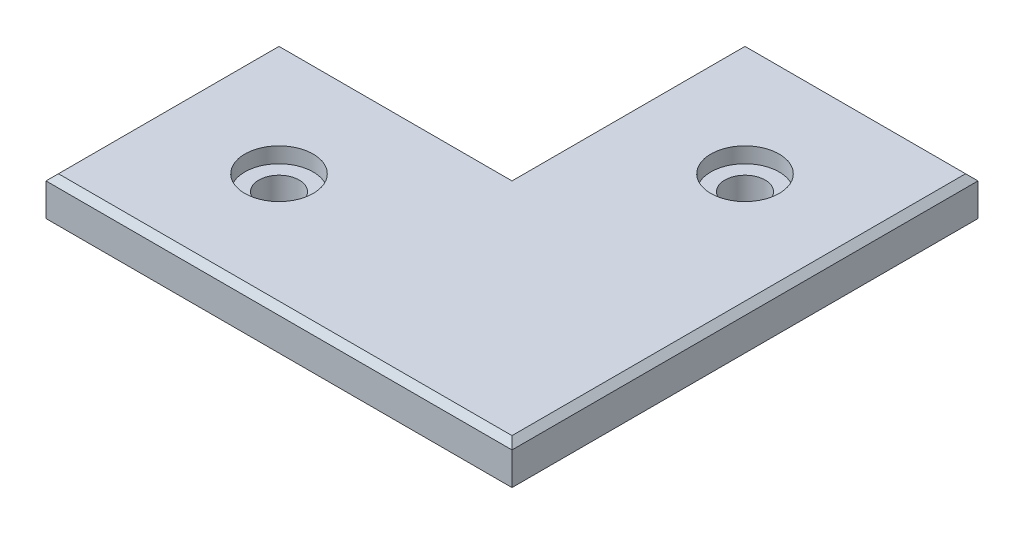
ISO-10303-21;
HEADER;
FILE_DESCRIPTION(('STEP AP214'),'2;1');
FILE_NAME('part.step','',(''),(''),'','','');
FILE_SCHEMA(('AUTOMOTIVE_DESIGN { 1 0 10303 214 1 1 1 1 }'));
ENDSEC;
DATA;
#1=APPLICATION_CONTEXT('core data for automotive mechanical design processes');
#2=APPLICATION_PROTOCOL_DEFINITION('international standard','automotive_design',2000,#1);
#3=PRODUCT_CONTEXT('',#1,'mechanical');
#4=PRODUCT('Part','Part','',(#3));
#5=PRODUCT_RELATED_PRODUCT_CATEGORY('part','',(#4));
#6=PRODUCT_DEFINITION_FORMATION('','',#4);
#7=PRODUCT_DEFINITION_CONTEXT('part definition',#1,'design');
#8=PRODUCT_DEFINITION('design','',#6,#7);
#9=PRODUCT_DEFINITION_SHAPE('','',#8);
#10=(LENGTH_UNIT() NAMED_UNIT(*) SI_UNIT(.MILLI.,.METRE.));
#11=(NAMED_UNIT(*) PLANE_ANGLE_UNIT() SI_UNIT($,.RADIAN.));
#12=(NAMED_UNIT(*) SI_UNIT($,.STERADIAN.) SOLID_ANGLE_UNIT());
#13=UNCERTAINTY_MEASURE_WITH_UNIT(LENGTH_MEASURE(1.E-05),#10,'distance_accuracy_value','');
#14=(GEOMETRIC_REPRESENTATION_CONTEXT(3) GLOBAL_UNCERTAINTY_ASSIGNED_CONTEXT((#13)) GLOBAL_UNIT_ASSIGNED_CONTEXT((#10,
#11,#12)) REPRESENTATION_CONTEXT('',''));
#15=CARTESIAN_POINT('',(0.,0.,0.));
#16=DIRECTION('',(0.,0.,1.));
#17=DIRECTION('',(1.,0.,0.));
#18=AXIS2_PLACEMENT_3D('',#15,#16,#17);
#19=CARTESIAN_POINT('',(49.9092726863167,15.6894663659119,115.954429940456));
#20=DIRECTION('',(0.,-1.,0.));
#21=DIRECTION('',(0.,0.,-1.));
#22=AXIS2_PLACEMENT_3D('',#19,#20,#21);
#23=CYLINDRICAL_SURFACE('',#22,3.302);
#24=CARTESIAN_POINT('',(49.9092726863167,0.,115.954429940456));
#25=DIRECTION('',(0.,1.,0.));
#26=DIRECTION('',(0.,0.,1.));
#27=AXIS2_PLACEMENT_3D('',#24,#25,#26);
#28=CIRCLE('',#27,3.302);
#29=CARTESIAN_POINT('',(49.9092726863167,0.,119.256429940456));
#30=VERTEX_POINT('',#29);
#31=EDGE_CURVE('E136',#30,#30,#28,.T.);
#32=ORIENTED_EDGE('',*,*,#31,.F.);
#33=EDGE_LOOP('',(#32));
#34=FACE_BOUND('',#33,.T.);
#35=CARTESIAN_POINT('',(49.9092726863167,3.81,115.954429940456));
#36=DIRECTION('',(0.,1.,0.));
#37=DIRECTION('',(0.,0.,1.));
#38=AXIS2_PLACEMENT_3D('',#35,#36,#37);
#39=CIRCLE('',#38,3.302);
#40=CARTESIAN_POINT('',(49.9092726863167,3.81,119.256429940456));
#41=VERTEX_POINT('',#40);
#42=EDGE_CURVE('E160',#41,#41,#39,.T.);
#43=ORIENTED_EDGE('',*,*,#42,.T.);
#44=EDGE_LOOP('',(#43));
#45=FACE_BOUND('',#44,.T.);
#46=ADVANCED_FACE('F38',(#34,#45),#23,.F.);
#47=CARTESIAN_POINT('',(11.8092726863168,15.6894663659119,154.054429940456));
#48=DIRECTION('',(0.,-1.,0.));
#49=DIRECTION('',(0.,0.,-1.));
#50=AXIS2_PLACEMENT_3D('',#47,#48,#49);
#51=CYLINDRICAL_SURFACE('',#50,3.302);
#52=CARTESIAN_POINT('',(11.8092726863168,0.,154.054429940456));
#53=DIRECTION('',(0.,1.,0.));
#54=DIRECTION('',(0.,0.,1.));
#55=AXIS2_PLACEMENT_3D('',#52,#53,#54);
#56=CIRCLE('',#55,3.302);
#57=CARTESIAN_POINT('',(11.8092726863168,0.,157.356429940456));
#58=VERTEX_POINT('',#57);
#59=EDGE_CURVE('E133',#58,#58,#56,.T.);
#60=ORIENTED_EDGE('',*,*,#59,.F.);
#61=EDGE_LOOP('',(#60));
#62=FACE_BOUND('',#61,.T.);
#63=CARTESIAN_POINT('',(11.8092726863168,3.81,154.054429940456));
#64=DIRECTION('',(0.,1.,0.));
#65=DIRECTION('',(0.,0.,1.));
#66=AXIS2_PLACEMENT_3D('',#63,#64,#65);
#67=CIRCLE('',#66,3.302);
#68=CARTESIAN_POINT('',(11.8092726863168,3.81,157.356429940456));
#69=VERTEX_POINT('',#68);
#70=EDGE_CURVE('E157',#69,#69,#67,.T.);
#71=ORIENTED_EDGE('',*,*,#70,.T.);
#72=EDGE_LOOP('',(#71));
#73=FACE_BOUND('',#72,.T.);
#74=ADVANCED_FACE('F244',(#62,#73),#51,.F.);
#75=CARTESIAN_POINT('',(68.9592726863167,6.35,96.9044299404562));
#76=DIRECTION('',(0.,0.,1.));
#77=DIRECTION('',(1.,0.,0.));
#78=AXIS2_PLACEMENT_3D('',#75,#76,#77);
#79=PLANE('',#78);
#80=DIRECTION('',(0.,-1.,0.));
#81=VECTOR('',#80,1.);
#82=CARTESIAN_POINT('',(30.8592726863167,6.35,96.9044299404562));
#83=LINE('',#82,#81);
#84=CARTESIAN_POINT('',(30.8592726863167,5.33400000000001,96.9044299404562));
#85=VERTEX_POINT('',#84);
#86=CARTESIAN_POINT('',(30.8592726863167,0.,96.9044299404562));
#87=VERTEX_POINT('',#86);
#88=EDGE_CURVE('E109',#85,#87,#83,.T.);
#89=ORIENTED_EDGE('',*,*,#88,.F.);
#90=DIRECTION('',(1.,0.,0.));
#91=VECTOR('',#90,1.);
#92=CARTESIAN_POINT('',(68.9592726863167,5.33400000000001,96.9044299404562));
#93=LINE('',#92,#91);
#94=CARTESIAN_POINT('',(68.9592726863167,5.33400000000001,96.9044299404562));
#95=VERTEX_POINT('',#94);
#96=EDGE_CURVE('E11',#85,#95,#93,.T.);
#97=ORIENTED_EDGE('',*,*,#96,.T.);
#98=DIRECTION('',(0.,-1.,0.));
#99=VECTOR('',#98,1.);
#100=CARTESIAN_POINT('',(68.9592726863167,6.35,96.9044299404562));
#101=LINE('',#100,#99);
#102=CARTESIAN_POINT('',(68.9592726863167,0.,96.9044299404562));
#103=VERTEX_POINT('',#102);
#104=EDGE_CURVE('E131',#95,#103,#101,.T.);
#105=ORIENTED_EDGE('',*,*,#104,.T.);
#106=DIRECTION('',(-1.,0.,0.));
#107=VECTOR('',#106,1.);
#108=CARTESIAN_POINT('',(68.9592726863167,0.,96.9044299404562));
#109=LINE('',#108,#107);
#110=EDGE_CURVE('E124',#103,#87,#109,.T.);
#111=ORIENTED_EDGE('',*,*,#110,.T.);
#112=EDGE_LOOP('',(#89,#97,#105,#111));
#113=FACE_BOUND('',#112,.T.);
#114=ADVANCED_FACE('F129',(#113),#79,.F.);
#115=CARTESIAN_POINT('',(30.8592726863167,6.35,96.9044299404562));
#116=DIRECTION('',(1.,0.,0.));
#117=DIRECTION('',(0.,0.,-1.));
#118=AXIS2_PLACEMENT_3D('',#115,#116,#117);
#119=PLANE('',#118);
#120=DIRECTION('',(0.,-1.,0.));
#121=VECTOR('',#120,1.);
#122=CARTESIAN_POINT('',(30.8592726863167,6.35,135.004429940456));
#123=LINE('',#122,#121);
#124=CARTESIAN_POINT('',(30.8592726863167,5.33400000000001,135.004429940456));
#125=VERTEX_POINT('',#124);
#126=CARTESIAN_POINT('',(30.8592726863167,0.,135.004429940456));
#127=VERTEX_POINT('',#126);
#128=EDGE_CURVE('E118',#125,#127,#123,.T.);
#129=ORIENTED_EDGE('',*,*,#128,.F.);
#130=DIRECTION('',(0.,0.,-1.));
#131=VECTOR('',#130,1.);
#132=CARTESIAN_POINT('',(30.8592726863167,5.33400000000001,96.9044299404562));
#133=LINE('',#132,#131);
#134=EDGE_CURVE('E48',#125,#85,#133,.T.);
#135=ORIENTED_EDGE('',*,*,#134,.T.);
#136=ORIENTED_EDGE('',*,*,#88,.T.);
#137=DIRECTION('',(0.,0.,1.));
#138=VECTOR('',#137,1.);
#139=CARTESIAN_POINT('',(30.8592726863167,0.,96.9044299404562));
#140=LINE('',#139,#138);
#141=EDGE_CURVE('E112',#87,#127,#140,.T.);
#142=ORIENTED_EDGE('',*,*,#141,.T.);
#143=EDGE_LOOP('',(#129,#135,#136,#142));
#144=FACE_BOUND('',#143,.T.);
#145=ADVANCED_FACE('F111',(#144),#119,.F.);
#146=CARTESIAN_POINT('',(30.8592726863167,6.35,135.004429940456));
#147=DIRECTION('',(0.,0.,1.));
#148=DIRECTION('',(1.,0.,0.));
#149=AXIS2_PLACEMENT_3D('',#146,#147,#148);
#150=PLANE('',#149);
#151=DIRECTION('',(0.,-1.,0.));
#152=VECTOR('',#151,1.);
#153=CARTESIAN_POINT('',(-7.2407273136832,6.35,135.004429940456));
#154=LINE('',#153,#152);
#155=CARTESIAN_POINT('',(-7.2407273136832,5.33400000000001,135.004429940456));
#156=VERTEX_POINT('',#155);
#157=CARTESIAN_POINT('',(-7.2407273136832,0.,135.004429940456));
#158=VERTEX_POINT('',#157);
#159=EDGE_CURVE('E154',#156,#158,#154,.T.);
#160=ORIENTED_EDGE('',*,*,#159,.F.);
#161=DIRECTION('',(1.,0.,0.));
#162=VECTOR('',#161,1.);
#163=CARTESIAN_POINT('',(30.8592726863167,5.33400000000001,135.004429940456));
#164=LINE('',#163,#162);
#165=EDGE_CURVE('E63',#156,#125,#164,.T.);
#166=ORIENTED_EDGE('',*,*,#165,.T.);
#167=ORIENTED_EDGE('',*,*,#128,.T.);
#168=DIRECTION('',(-1.,0.,0.));
#169=VECTOR('',#168,1.);
#170=CARTESIAN_POINT('',(30.8592726863167,0.,135.004429940456));
#171=LINE('',#170,#169);
#172=EDGE_CURVE('E127',#127,#158,#171,.T.);
#173=ORIENTED_EDGE('',*,*,#172,.T.);
#174=EDGE_LOOP('',(#160,#166,#167,#173));
#175=FACE_BOUND('',#174,.T.);
#176=ADVANCED_FACE('F384',(#175),#150,.F.);
#177=CARTESIAN_POINT('',(-7.2407273136832,6.35,135.004429940456));
#178=DIRECTION('',(1.,0.,0.));
#179=DIRECTION('',(0.,0.,-1.));
#180=AXIS2_PLACEMENT_3D('',#177,#178,#179);
#181=PLANE('',#180);
#182=DIRECTION('',(0.,-1.,0.));
#183=VECTOR('',#182,1.);
#184=CARTESIAN_POINT('',(-7.24072731368319,6.35,173.104429940456));
#185=LINE('',#184,#183);
#186=CARTESIAN_POINT('',(-7.24072731368319,5.33400000000001,173.104429940456));
#187=VERTEX_POINT('',#186);
#188=CARTESIAN_POINT('',(-7.24072731368319,0.,173.104429940456));
#189=VERTEX_POINT('',#188);
#190=EDGE_CURVE('E152',#187,#189,#185,.T.);
#191=ORIENTED_EDGE('',*,*,#190,.F.);
#192=DIRECTION('',(0.,0.,-1.));
#193=VECTOR('',#192,1.);
#194=CARTESIAN_POINT('',(-7.2407273136832,5.33400000000001,135.004429940456));
#195=LINE('',#194,#193);
#196=EDGE_CURVE('E181',#187,#156,#195,.T.);
#197=ORIENTED_EDGE('',*,*,#196,.T.);
#198=ORIENTED_EDGE('',*,*,#159,.T.);
#199=DIRECTION('',(0.,0.,1.));
#200=VECTOR('',#199,1.);
#201=CARTESIAN_POINT('',(-7.2407273136832,0.,135.004429940456));
#202=LINE('',#201,#200);
#203=EDGE_CURVE('E141',#158,#189,#202,.T.);
#204=ORIENTED_EDGE('',*,*,#203,.T.);
#205=EDGE_LOOP('',(#191,#197,#198,#204));
#206=FACE_BOUND('',#205,.T.);
#207=ADVANCED_FACE('F375',(#206),#181,.F.);
#208=CARTESIAN_POINT('',(-7.24072731368319,6.35,173.104429940456));
#209=DIRECTION('',(0.,0.,-1.));
#210=DIRECTION('',(-1.,0.,0.));
#211=AXIS2_PLACEMENT_3D('',#208,#209,#210);
#212=PLANE('',#211);
#213=DIRECTION('',(0.,-1.,0.));
#214=VECTOR('',#213,1.);
#215=CARTESIAN_POINT('',(68.9592726863166,6.35,173.104429940456));
#216=LINE('',#215,#214);
#217=CARTESIAN_POINT('',(68.9592726863166,5.33400000000001,173.104429940456));
#218=VERTEX_POINT('',#217);
#219=CARTESIAN_POINT('',(68.9592726863166,0.,173.104429940456));
#220=VERTEX_POINT('',#219);
#221=EDGE_CURVE('E150',#218,#220,#216,.T.);
#222=ORIENTED_EDGE('',*,*,#221,.F.);
#223=DIRECTION('',(-1.,0.,0.));
#224=VECTOR('',#223,1.);
#225=CARTESIAN_POINT('',(-7.24072731368319,5.33400000000001,173.104429940456));
#226=LINE('',#225,#224);
#227=EDGE_CURVE('E179',#218,#187,#226,.T.);
#228=ORIENTED_EDGE('',*,*,#227,.T.);
#229=ORIENTED_EDGE('',*,*,#190,.T.);
#230=DIRECTION('',(1.,0.,0.));
#231=VECTOR('',#230,1.);
#232=CARTESIAN_POINT('',(-7.24072731368319,0.,173.104429940456));
#233=LINE('',#232,#231);
#234=EDGE_CURVE('E144',#189,#220,#233,.T.);
#235=ORIENTED_EDGE('',*,*,#234,.T.);
#236=EDGE_LOOP('',(#222,#228,#229,#235));
#237=FACE_BOUND('',#236,.T.);
#238=ADVANCED_FACE('F239',(#237),#212,.F.);
#239=CARTESIAN_POINT('',(68.9592726863166,6.35,173.104429940456));
#240=DIRECTION('',(-1.,0.,0.));
#241=DIRECTION('',(0.,0.,1.));
#242=AXIS2_PLACEMENT_3D('',#239,#240,#241);
#243=PLANE('',#242);
#244=ORIENTED_EDGE('',*,*,#104,.F.);
#245=DIRECTION('',(0.,0.,1.));
#246=VECTOR('',#245,1.);
#247=CARTESIAN_POINT('',(68.9592726863166,5.33400000000001,173.104429940456));
#248=LINE('',#247,#246);
#249=EDGE_CURVE('E176',#95,#218,#248,.T.);
#250=ORIENTED_EDGE('',*,*,#249,.T.);
#251=ORIENTED_EDGE('',*,*,#221,.T.);
#252=DIRECTION('',(0.,0.,-1.));
#253=VECTOR('',#252,1.);
#254=CARTESIAN_POINT('',(68.9592726863166,0.,173.104429940456));
#255=LINE('',#254,#253);
#256=EDGE_CURVE('E147',#220,#103,#255,.T.);
#257=ORIENTED_EDGE('',*,*,#256,.T.);
#258=EDGE_LOOP('',(#244,#250,#251,#257));
#259=FACE_BOUND('',#258,.T.);
#260=ADVANCED_FACE('F230',(#259),#243,.F.);
#261=CARTESIAN_POINT('',(0.,6.35,0.));
#262=DIRECTION('',(0.,1.,0.));
#263=DIRECTION('',(0.,0.,1.));
#264=AXIS2_PLACEMENT_3D('',#261,#262,#263);
#265=PLANE('',#264);
#266=DIRECTION('',(1.,0.,0.));
#267=VECTOR('',#266,1.);
#268=CARTESIAN_POINT('',(68.9592726863166,6.35,172.088429940456));
#269=LINE('',#268,#267);
#270=CARTESIAN_POINT('',(-6.22472731368319,6.35,172.088429940456));
#271=VERTEX_POINT('',#270);
#272=CARTESIAN_POINT('',(67.9432726863166,6.35,172.088429940456));
#273=VERTEX_POINT('',#272);
#274=EDGE_CURVE('E171',#271,#273,#269,.T.);
#275=ORIENTED_EDGE('',*,*,#274,.T.);
#276=DIRECTION('',(0.,0.,-1.));
#277=VECTOR('',#276,1.);
#278=CARTESIAN_POINT('',(67.9432726863167,6.35,96.9044299404562));
#279=LINE('',#278,#277);
#280=CARTESIAN_POINT('',(67.9432726863167,6.35,97.9204299404562));
#281=VERTEX_POINT('',#280);
#282=EDGE_CURVE('E173',#273,#281,#279,.T.);
#283=ORIENTED_EDGE('',*,*,#282,.T.);
#284=DIRECTION('',(-1.,0.,0.));
#285=VECTOR('',#284,1.);
#286=CARTESIAN_POINT('',(30.8592726863167,6.35,97.9204299404562));
#287=LINE('',#286,#285);
#288=CARTESIAN_POINT('',(31.8752726863167,6.35,97.9204299404562));
#289=VERTEX_POINT('',#288);
#290=EDGE_CURVE('E117',#281,#289,#287,.T.);
#291=ORIENTED_EDGE('',*,*,#290,.T.);
#292=DIRECTION('',(0.,0.,1.));
#293=VECTOR('',#292,1.);
#294=CARTESIAN_POINT('',(31.8752726863167,6.35,135.004429940456));
#295=LINE('',#294,#293);
#296=CARTESIAN_POINT('',(31.8752726863167,6.35,136.020429940456));
#297=VERTEX_POINT('',#296);
#298=EDGE_CURVE('E165',#289,#297,#295,.T.);
#299=ORIENTED_EDGE('',*,*,#298,.T.);
#300=DIRECTION('',(-1.,0.,0.));
#301=VECTOR('',#300,1.);
#302=CARTESIAN_POINT('',(-7.2407273136832,6.35,136.020429940456));
#303=LINE('',#302,#301);
#304=CARTESIAN_POINT('',(-6.22472731368319,6.35,136.020429940456));
#305=VERTEX_POINT('',#304);
#306=EDGE_CURVE('E167',#297,#305,#303,.T.);
#307=ORIENTED_EDGE('',*,*,#306,.T.);
#308=DIRECTION('',(0.,0.,1.));
#309=VECTOR('',#308,1.);
#310=CARTESIAN_POINT('',(-6.22472731368319,6.35,173.104429940456));
#311=LINE('',#310,#309);
#312=EDGE_CURVE('E169',#305,#271,#311,.T.);
#313=ORIENTED_EDGE('',*,*,#312,.T.);
#314=EDGE_LOOP('',(#275,#283,#291,#299,#307,#313));
#315=FACE_BOUND('',#314,.T.);
#316=CARTESIAN_POINT('',(11.8092726863168,6.35,154.054429940456));
#317=DIRECTION('',(0.,1.,0.));
#318=DIRECTION('',(0.,0.,1.));
#319=AXIS2_PLACEMENT_3D('',#316,#317,#318);
#320=CIRCLE('',#319,5.588);
#321=CARTESIAN_POINT('',(11.8092726863168,6.35,159.642429940456));
#322=VERTEX_POINT('',#321);
#323=EDGE_CURVE('E211',#322,#322,#320,.T.);
#324=ORIENTED_EDGE('',*,*,#323,.F.);
#325=EDGE_LOOP('',(#324));
#326=FACE_BOUND('',#325,.T.);
#327=CARTESIAN_POINT('',(49.9092726863167,6.35,115.954429940456));
#328=DIRECTION('',(0.,1.,0.));
#329=DIRECTION('',(0.,0.,1.));
#330=AXIS2_PLACEMENT_3D('',#327,#328,#329);
#331=CIRCLE('',#330,5.588);
#332=CARTESIAN_POINT('',(49.9092726863167,6.35,121.542429940456));
#333=VERTEX_POINT('',#332);
#334=EDGE_CURVE('E200',#333,#333,#331,.T.);
#335=ORIENTED_EDGE('',*,*,#334,.F.);
#336=EDGE_LOOP('',(#335));
#337=FACE_BOUND('',#336,.T.);
#338=ADVANCED_FACE('F227',(#315,#326,#337),#265,.T.);
#339=CARTESIAN_POINT('',(0.,0.,0.));
#340=DIRECTION('',(0.,1.,0.));
#341=DIRECTION('',(0.,0.,1.));
#342=AXIS2_PLACEMENT_3D('',#339,#340,#341);
#343=PLANE('',#342);
#344=ORIENTED_EDGE('',*,*,#59,.T.);
#345=EDGE_LOOP('',(#344));
#346=FACE_BOUND('',#345,.T.);
#347=ORIENTED_EDGE('',*,*,#31,.T.);
#348=EDGE_LOOP('',(#347));
#349=FACE_BOUND('',#348,.T.);
#350=ORIENTED_EDGE('',*,*,#110,.F.);
#351=ORIENTED_EDGE('',*,*,#256,.F.);
#352=ORIENTED_EDGE('',*,*,#234,.F.);
#353=ORIENTED_EDGE('',*,*,#203,.F.);
#354=ORIENTED_EDGE('',*,*,#172,.F.);
#355=ORIENTED_EDGE('',*,*,#141,.F.);
#356=EDGE_LOOP('',(#350,#351,#352,#353,#354,#355));
#357=FACE_BOUND('',#356,.T.);
#358=ADVANCED_FACE('F122',(#346,#349,#357),#343,.F.);
#359=CARTESIAN_POINT('',(11.8092726863168,3.81,154.054429940456));
#360=DIRECTION('',(0.,1.,0.));
#361=DIRECTION('',(0.,0.,1.));
#362=AXIS2_PLACEMENT_3D('',#359,#360,#361);
#363=CYLINDRICAL_SURFACE('',#362,5.588);
#364=CARTESIAN_POINT('',(11.8092726863168,3.81,154.054429940456));
#365=DIRECTION('',(0.,1.,0.));
#366=DIRECTION('',(0.,0.,1.));
#367=AXIS2_PLACEMENT_3D('',#364,#365,#366);
#368=CIRCLE('',#367,5.588);
#369=CARTESIAN_POINT('',(11.8092726863168,3.81,159.642429940456));
#370=VERTEX_POINT('',#369);
#371=EDGE_CURVE('E161',#370,#370,#368,.T.);
#372=ORIENTED_EDGE('',*,*,#371,.F.);
#373=EDGE_LOOP('',(#372));
#374=FACE_BOUND('',#373,.T.);
#375=ORIENTED_EDGE('',*,*,#323,.T.);
#376=EDGE_LOOP('',(#375));
#377=FACE_BOUND('',#376,.T.);
#378=ADVANCED_FACE('F221',(#374,#377),#363,.F.);
#379=CARTESIAN_POINT('',(11.8092726863168,3.81,154.054429940456));
#380=DIRECTION('',(0.,1.,0.));
#381=DIRECTION('',(0.,0.,1.));
#382=AXIS2_PLACEMENT_3D('',#379,#380,#381);
#383=PLANE('',#382);
#384=ORIENTED_EDGE('',*,*,#70,.F.);
#385=EDGE_LOOP('',(#384));
#386=FACE_BOUND('',#385,.T.);
#387=ORIENTED_EDGE('',*,*,#371,.T.);
#388=EDGE_LOOP('',(#387));
#389=FACE_BOUND('',#388,.T.);
#390=ADVANCED_FACE('F219',(#386,#389),#383,.T.);
#391=CARTESIAN_POINT('',(49.9092726863167,3.81,115.954429940456));
#392=DIRECTION('',(0.,1.,0.));
#393=DIRECTION('',(0.,0.,1.));
#394=AXIS2_PLACEMENT_3D('',#391,#392,#393);
#395=CYLINDRICAL_SURFACE('',#394,5.588);
#396=CARTESIAN_POINT('',(49.9092726863167,3.81,115.954429940456));
#397=DIRECTION('',(0.,1.,0.));
#398=DIRECTION('',(0.,0.,1.));
#399=AXIS2_PLACEMENT_3D('',#396,#397,#398);
#400=CIRCLE('',#399,5.588);
#401=CARTESIAN_POINT('',(49.9092726863167,3.81,121.542429940456));
#402=VERTEX_POINT('',#401);
#403=EDGE_CURVE('E206',#402,#402,#400,.T.);
#404=ORIENTED_EDGE('',*,*,#403,.F.);
#405=EDGE_LOOP('',(#404));
#406=FACE_BOUND('',#405,.T.);
#407=ORIENTED_EDGE('',*,*,#334,.T.);
#408=EDGE_LOOP('',(#407));
#409=FACE_BOUND('',#408,.T.);
#410=ADVANCED_FACE('F254',(#406,#409),#395,.F.);
#411=CARTESIAN_POINT('',(49.9092726863167,3.81,115.954429940456));
#412=DIRECTION('',(0.,1.,0.));
#413=DIRECTION('',(0.,0.,1.));
#414=AXIS2_PLACEMENT_3D('',#411,#412,#413);
#415=PLANE('',#414);
#416=ORIENTED_EDGE('',*,*,#42,.F.);
#417=EDGE_LOOP('',(#416));
#418=FACE_BOUND('',#417,.T.);
#419=ORIENTED_EDGE('',*,*,#403,.T.);
#420=EDGE_LOOP('',(#419));
#421=FACE_BOUND('',#420,.T.);
#422=ADVANCED_FACE('F257',(#418,#421),#415,.T.);
#423=CARTESIAN_POINT('',(-2.9726971090415E-13,6.35,136.020429940456));
#424=DIRECTION('',(0.,0.707106781186561,-0.707106781186534));
#425=DIRECTION('',(1.,0.,0.));
#426=AXIS2_PLACEMENT_3D('',#423,#424,#425);
#427=PLANE('',#426);
#428=DIRECTION('',(0.577350269189623,0.577350269189615,0.577350269189639));
#429=VECTOR('',#428,1.);
#430=CARTESIAN_POINT('',(21.2501817908778,-4.27509089543878,125.395339045017));
#431=LINE('',#430,#429);
#432=EDGE_CURVE('E194',#125,#297,#431,.T.);
#433=ORIENTED_EDGE('',*,*,#432,.F.);
#434=ORIENTED_EDGE('',*,*,#165,.F.);
#435=DIRECTION('',(0.577350269189623,0.577350269189615,0.577350269189639));
#436=VECTOR('',#435,1.);
#437=CARTESIAN_POINT('',(-4.14981820912224,8.42490910456092,138.095339045017));
#438=LINE('',#437,#436);
#439=EDGE_CURVE('E43',#305,#156,#438,.F.);
#440=ORIENTED_EDGE('',*,*,#439,.F.);
#441=ORIENTED_EDGE('',*,*,#306,.F.);
#442=EDGE_LOOP('',(#433,#434,#440,#441));
#443=FACE_BOUND('',#442,.T.);
#444=ADVANCED_FACE('F41',(#443),#427,.T.);
#445=CARTESIAN_POINT('',(-6.2247273136832,6.35,0.));
#446=DIRECTION('',(-0.707106781186543,0.707106781186552,0.));
#447=DIRECTION('',(0.,0.,-1.));
#448=AXIS2_PLACEMENT_3D('',#445,#446,#447);
#449=PLANE('',#448);
#450=ORIENTED_EDGE('',*,*,#439,.T.);
#451=ORIENTED_EDGE('',*,*,#196,.F.);
#452=DIRECTION('',(0.577350269189631,0.577350269189623,-0.577350269189623));
#453=VECTOR('',#452,1.);
#454=CARTESIAN_POINT('',(51.1380826664692,63.7128099801516,114.725619960305));
#455=LINE('',#454,#453);
#456=EDGE_CURVE('E192',#271,#187,#455,.F.);
#457=ORIENTED_EDGE('',*,*,#456,.F.);
#458=ORIENTED_EDGE('',*,*,#312,.F.);
#459=EDGE_LOOP('',(#450,#451,#457,#458));
#460=FACE_BOUND('',#459,.T.);
#461=ADVANCED_FACE('F285',(#460),#449,.T.);
#462=CARTESIAN_POINT('',(31.8752726863167,6.35,0.));
#463=DIRECTION('',(-0.707106781186543,0.707106781186552,0.));
#464=DIRECTION('',(0.,0.,-1.));
#465=AXIS2_PLACEMENT_3D('',#462,#463,#464);
#466=PLANE('',#465);
#467=ORIENTED_EDGE('',*,*,#432,.T.);
#468=ORIENTED_EDGE('',*,*,#298,.F.);
#469=DIRECTION('',(0.577350269189628,0.577350269189621,0.577350269189628));
#470=VECTOR('',#469,1.);
#471=CARTESIAN_POINT('',(21.2501817908777,-4.27509089543885,87.2953390450172));
#472=LINE('',#471,#470);
#473=EDGE_CURVE('E189',#85,#289,#472,.T.);
#474=ORIENTED_EDGE('',*,*,#473,.F.);
#475=ORIENTED_EDGE('',*,*,#134,.F.);
#476=EDGE_LOOP('',(#467,#468,#474,#475));
#477=FACE_BOUND('',#476,.T.);
#478=ADVANCED_FACE('F292',(#477),#466,.T.);
#479=CARTESIAN_POINT('',(0.,6.35,172.088429940456));
#480=DIRECTION('',(0.,0.707106781186548,0.707106781186548));
#481=DIRECTION('',(-1.,0.,0.));
#482=AXIS2_PLACEMENT_3D('',#479,#480,#481);
#483=PLANE('',#482);
#484=ORIENTED_EDGE('',*,*,#456,.T.);
#485=ORIENTED_EDGE('',*,*,#227,.F.);
#486=DIRECTION('',(-0.577350269189629,0.577350269189624,-0.577350269189624));
#487=VECTOR('',#486,1.);
#488=CARTESIAN_POINT('',(45.2955151242109,28.9977575621056,149.440672378351));
#489=LINE('',#488,#487);
#490=EDGE_CURVE('E187',#273,#218,#489,.F.);
#491=ORIENTED_EDGE('',*,*,#490,.F.);
#492=ORIENTED_EDGE('',*,*,#274,.F.);
#493=EDGE_LOOP('',(#484,#485,#491,#492));
#494=FACE_BOUND('',#493,.T.);
#495=ADVANCED_FACE('F298',(#494),#483,.T.);
#496=CARTESIAN_POINT('',(0.,6.35,97.9204299404562));
#497=DIRECTION('',(0.,0.707106781186552,-0.707106781186543));
#498=DIRECTION('',(1.,0.,0.));
#499=AXIS2_PLACEMENT_3D('',#496,#497,#498);
#500=PLANE('',#499);
#501=ORIENTED_EDGE('',*,*,#473,.T.);
#502=ORIENTED_EDGE('',*,*,#290,.F.);
#503=DIRECTION('',(0.577350269189627,-0.577350269189621,-0.577350269189629));
#504=VECTOR('',#503,1.);
#505=CARTESIAN_POINT('',(45.295515124211,28.9977575621054,120.568187502562));
#506=LINE('',#505,#504);
#507=EDGE_CURVE('E185',#95,#281,#506,.F.);
#508=ORIENTED_EDGE('',*,*,#507,.F.);
#509=ORIENTED_EDGE('',*,*,#96,.F.);
#510=EDGE_LOOP('',(#501,#502,#508,#509));
#511=FACE_BOUND('',#510,.T.);
#512=ADVANCED_FACE('F305',(#511),#500,.T.);
#513=CARTESIAN_POINT('',(67.9432726863168,6.35,0.));
#514=DIRECTION('',(0.707106781186544,0.70710678118655,0.));
#515=DIRECTION('',(0.,0.,1.));
#516=AXIS2_PLACEMENT_3D('',#513,#514,#515);
#517=PLANE('',#516);
#518=ORIENTED_EDGE('',*,*,#490,.T.);
#519=ORIENTED_EDGE('',*,*,#249,.F.);
#520=ORIENTED_EDGE('',*,*,#507,.T.);
#521=ORIENTED_EDGE('',*,*,#282,.F.);
#522=EDGE_LOOP('',(#518,#519,#520,#521));
#523=FACE_BOUND('',#522,.T.);
#524=ADVANCED_FACE('F313',(#523),#517,.T.);
#525=CLOSED_SHELL('',(#46,#74,#114,#145,#176,#207,#238,#260,#338,#358,#378,#390,#410,#422,#444,
#461,#478,#495,#512,#524));
#526=MANIFOLD_SOLID_BREP('B2',#525);
#527=ADVANCED_BREP_SHAPE_REPRESENTATION('',(#18,#526),#14);
#528=SHAPE_DEFINITION_REPRESENTATION(#9,#527);
ENDSEC;
END-ISO-10303-21;
